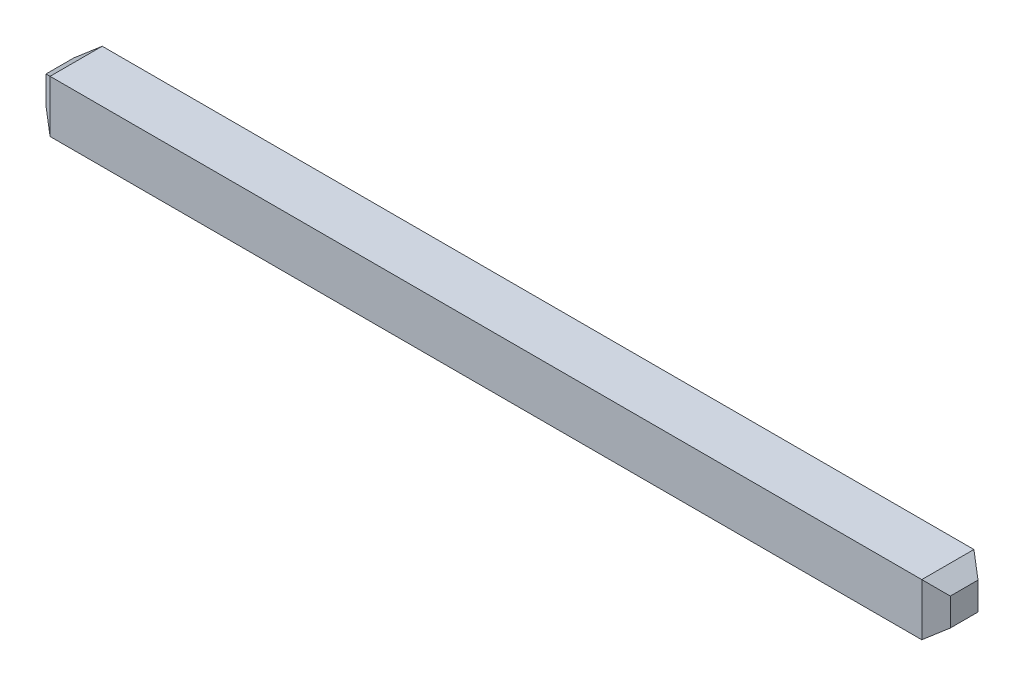
ISO-10303-21;
HEADER;
FILE_DESCRIPTION(('STEP AP214'),'2;1');
FILE_NAME('part.step','',(''),(''),'','','');
FILE_SCHEMA(('AUTOMOTIVE_DESIGN { 1 0 10303 214 1 1 1 1 }'));
ENDSEC;
DATA;
#1=APPLICATION_CONTEXT('core data for automotive mechanical design processes');
#2=APPLICATION_PROTOCOL_DEFINITION('international standard','automotive_design',2000,#1);
#3=PRODUCT_CONTEXT('',#1,'mechanical');
#4=PRODUCT('Part','Part','',(#3));
#5=PRODUCT_RELATED_PRODUCT_CATEGORY('part','',(#4));
#6=PRODUCT_DEFINITION_FORMATION('','',#4);
#7=PRODUCT_DEFINITION_CONTEXT('part definition',#1,'design');
#8=PRODUCT_DEFINITION('design','',#6,#7);
#9=PRODUCT_DEFINITION_SHAPE('','',#8);
#10=(LENGTH_UNIT() NAMED_UNIT(*) SI_UNIT(.MILLI.,.METRE.));
#11=(NAMED_UNIT(*) PLANE_ANGLE_UNIT() SI_UNIT($,.RADIAN.));
#12=(NAMED_UNIT(*) SI_UNIT($,.STERADIAN.) SOLID_ANGLE_UNIT());
#13=UNCERTAINTY_MEASURE_WITH_UNIT(LENGTH_MEASURE(1.E-05),#10,'distance_accuracy_value','');
#14=(GEOMETRIC_REPRESENTATION_CONTEXT(3) GLOBAL_UNCERTAINTY_ASSIGNED_CONTEXT((#13)) GLOBAL_UNIT_ASSIGNED_CONTEXT((#10,
#11,#12)) REPRESENTATION_CONTEXT('',''));
#15=CARTESIAN_POINT('',(0.,0.,0.));
#16=DIRECTION('',(0.,0.,1.));
#17=DIRECTION('',(1.,0.,0.));
#18=AXIS2_PLACEMENT_3D('',#15,#16,#17);
#19=CARTESIAN_POINT('',(-2.4,1.23,-37.075));
#20=DIRECTION('',(0.5999999999908,0.,0.8000000000069));
#21=DIRECTION('',(0.8000000000069,0.,-0.5999999999908));
#22=AXIS2_PLACEMENT_3D('',#19,#20,#21);
#23=PLANE('',#22);
#24=DIRECTION('',(0.,1.,0.));
#25=VECTOR('',#24,1.);
#26=CARTESIAN_POINT('',(-2.3,1.23,-37.15));
#27=LINE('',#26,#25);
#28=CARTESIAN_POINT('',(-2.29999999999957,1.55,-37.1499999999994));
#29=VERTEX_POINT('',#28);
#30=CARTESIAN_POINT('',(-2.29999999999958,0.909999999999898,-37.1499999999994));
#31=VERTEX_POINT('',#30);
#32=EDGE_CURVE('E101',#29,#31,#27,.F.);
#33=ORIENTED_EDGE('',*,*,#32,.T.);
#34=DIRECTION('',(-0.685994340569487,0.514495755428337,0.514495755427447));
#35=VECTOR('',#34,1.);
#36=CARTESIAN_POINT('',(-2.30000000000009,0.909999999999786,-37.15));
#37=LINE('',#36,#35);
#38=CARTESIAN_POINT('',(-2.50000000000021,1.06000000000001,-37.0000000000003));
#39=VERTEX_POINT('',#38);
#40=EDGE_CURVE('E85',#31,#39,#37,.T.);
#41=ORIENTED_EDGE('',*,*,#40,.T.);
#42=DIRECTION('',(0.,1.,0.));
#43=VECTOR('',#42,1.);
#44=CARTESIAN_POINT('',(-2.5,1.23,-37.));
#45=LINE('',#44,#43);
#46=CARTESIAN_POINT('',(-2.50000000000043,1.4,-37.0000000000006));
#47=VERTEX_POINT('',#46);
#48=EDGE_CURVE('E79',#39,#47,#45,.T.);
#49=ORIENTED_EDGE('',*,*,#48,.T.);
#50=DIRECTION('',(-0.68599434057003,-0.514495755427523,0.514495755427537));
#51=VECTOR('',#50,1.);
#52=CARTESIAN_POINT('',(-2.3,1.55,-37.15));
#53=LINE('',#52,#51);
#54=EDGE_CURVE('E20',#29,#47,#53,.T.);
#55=ORIENTED_EDGE('',*,*,#54,.F.);
#56=EDGE_LOOP('',(#33,#41,#49,#55));
#57=FACE_BOUND('',#56,.T.);
#58=ADVANCED_FACE('F17',(#57),#23,.F.);
#59=CARTESIAN_POINT('',(8.5,1.23,-37.075));
#60=DIRECTION('',(-0.5999999999908,0.,0.8000000000069));
#61=DIRECTION('',(0.8000000000069,0.,0.5999999999908));
#62=AXIS2_PLACEMENT_3D('',#59,#60,#61);
#63=PLANE('',#62);
#64=DIRECTION('',(0.,1.,0.));
#65=VECTOR('',#64,1.);
#66=CARTESIAN_POINT('',(8.6,1.23,-37.));
#67=LINE('',#66,#65);
#68=CARTESIAN_POINT('',(8.6000000000002,1.06000000000003,-37.0000000000003));
#69=VERTEX_POINT('',#68);
#70=CARTESIAN_POINT('',(8.60000000000043,1.4,-37.0000000000006));
#71=VERTEX_POINT('',#70);
#72=EDGE_CURVE('E113',#69,#71,#67,.T.);
#73=ORIENTED_EDGE('',*,*,#72,.F.);
#74=DIRECTION('',(-0.685994340569488,-0.514495755428337,-0.514495755427446));
#75=VECTOR('',#74,1.);
#76=CARTESIAN_POINT('',(8.59999999999996,1.06000000000005,-37.));
#77=LINE('',#76,#75);
#78=CARTESIAN_POINT('',(8.39999999999959,0.909999999999884,-37.1499999999994));
#79=VERTEX_POINT('',#78);
#80=EDGE_CURVE('E108',#69,#79,#77,.T.);
#81=ORIENTED_EDGE('',*,*,#80,.T.);
#82=DIRECTION('',(0.,1.,0.));
#83=VECTOR('',#82,1.);
#84=CARTESIAN_POINT('',(8.4,1.23,-37.15));
#85=LINE('',#84,#83);
#86=CARTESIAN_POINT('',(8.39999999999957,1.55,-37.1499999999994));
#87=VERTEX_POINT('',#86);
#88=EDGE_CURVE('E99',#79,#87,#85,.T.);
#89=ORIENTED_EDGE('',*,*,#88,.T.);
#90=DIRECTION('',(-0.685994340570029,0.514495755427522,-0.51449575542754));
#91=VECTOR('',#90,1.);
#92=CARTESIAN_POINT('',(8.6,1.4,-37.));
#93=LINE('',#92,#91);
#94=EDGE_CURVE('E116',#71,#87,#93,.T.);
#95=ORIENTED_EDGE('',*,*,#94,.F.);
#96=EDGE_LOOP('',(#73,#81,#89,#95));
#97=FACE_BOUND('',#96,.T.);
#98=ADVANCED_FACE('F214',(#97),#63,.F.);
#99=CARTESIAN_POINT('',(-2.4,1.475,-36.83));
#100=DIRECTION('',(-0.6,0.8,0.));
#101=DIRECTION('',(-0.8,-0.6,0.));
#102=AXIS2_PLACEMENT_3D('',#99,#100,#101);
#103=PLANE('',#102);
#104=DIRECTION('',(-0.685994340575993,-0.514495755427534,-0.514495755419575));
#105=VECTOR('',#104,1.);
#106=CARTESIAN_POINT('',(-2.29999999999913,1.55,-36.5100000000012));
#107=LINE('',#106,#105);
#108=CARTESIAN_POINT('',(-2.29999999999989,1.55,-36.5100000000001));
#109=VERTEX_POINT('',#108);
#110=CARTESIAN_POINT('',(-2.50000000000022,1.4,-36.6599999999997));
#111=VERTEX_POINT('',#110);
#112=EDGE_CURVE('E128',#109,#111,#107,.T.);
#113=ORIENTED_EDGE('',*,*,#112,.F.);
#114=DIRECTION('',(0.,0.,1.));
#115=VECTOR('',#114,1.);
#116=CARTESIAN_POINT('',(-2.3,1.55,-36.83));
#117=LINE('',#116,#115);
#118=EDGE_CURVE('E93',#29,#109,#117,.T.);
#119=ORIENTED_EDGE('',*,*,#118,.F.);
#120=ORIENTED_EDGE('',*,*,#54,.T.);
#121=DIRECTION('',(0.,0.,-1.));
#122=VECTOR('',#121,1.);
#123=CARTESIAN_POINT('',(-2.5,1.4,-36.83));
#124=LINE('',#123,#122);
#125=EDGE_CURVE('E87',#47,#111,#124,.F.);
#126=ORIENTED_EDGE('',*,*,#125,.T.);
#127=EDGE_LOOP('',(#113,#119,#120,#126));
#128=FACE_BOUND('',#127,.T.);
#129=ADVANCED_FACE('F90',(#128),#103,.T.);
#130=CARTESIAN_POINT('',(-2.5,1.23,-36.83));
#131=DIRECTION('',(1.,0.,0.));
#132=DIRECTION('',(0.,0.,-1.));
#133=AXIS2_PLACEMENT_3D('',#130,#131,#132);
#134=PLANE('',#133);
#135=DIRECTION('',(0.,1.,0.));
#136=VECTOR('',#135,1.);
#137=CARTESIAN_POINT('',(-2.50000000000087,1.23,-36.6599999999988));
#138=LINE('',#137,#136);
#139=CARTESIAN_POINT('',(-2.50000000000021,1.06000000000001,-36.6599999999997));
#140=VERTEX_POINT('',#139);
#141=EDGE_CURVE('E97',#111,#140,#138,.F.);
#142=ORIENTED_EDGE('',*,*,#141,.F.);
#143=ORIENTED_EDGE('',*,*,#125,.F.);
#144=ORIENTED_EDGE('',*,*,#48,.F.);
#145=DIRECTION('',(0.,0.,1.));
#146=VECTOR('',#145,1.);
#147=CARTESIAN_POINT('',(-2.49999999999996,1.06000000000005,-36.83));
#148=LINE('',#147,#146);
#149=EDGE_CURVE('E105',#39,#140,#148,.T.);
#150=ORIENTED_EDGE('',*,*,#149,.T.);
#151=EDGE_LOOP('',(#142,#143,#144,#150));
#152=FACE_BOUND('',#151,.T.);
#153=ADVANCED_FACE('F95',(#152),#134,.F.);
#154=CARTESIAN_POINT('',(3.05,1.23,-37.15));
#155=DIRECTION('',(0.,0.,1.));
#156=DIRECTION('',(1.,0.,0.));
#157=AXIS2_PLACEMENT_3D('',#154,#155,#156);
#158=PLANE('',#157);
#159=ORIENTED_EDGE('',*,*,#32,.F.);
#160=DIRECTION('',(1.,0.,0.));
#161=VECTOR('',#160,1.);
#162=CARTESIAN_POINT('',(3.05,1.55,-37.15));
#163=LINE('',#162,#161);
#164=EDGE_CURVE('E122',#87,#29,#163,.F.);
#165=ORIENTED_EDGE('',*,*,#164,.F.);
#166=ORIENTED_EDGE('',*,*,#88,.F.);
#167=DIRECTION('',(1.,0.,0.));
#168=VECTOR('',#167,1.);
#169=CARTESIAN_POINT('',(3.05,0.91,-37.15));
#170=LINE('',#169,#168);
#171=EDGE_CURVE('E136',#79,#31,#170,.F.);
#172=ORIENTED_EDGE('',*,*,#171,.T.);
#173=EDGE_LOOP('',(#159,#165,#166,#172));
#174=FACE_BOUND('',#173,.T.);
#175=ADVANCED_FACE('F182',(#174),#158,.F.);
#176=CARTESIAN_POINT('',(-2.4,0.9849999999999,-36.83));
#177=DIRECTION('',(0.600000000000912,0.799999999999316,0.));
#178=DIRECTION('',(-0.799999999999316,0.600000000000912,0.));
#179=AXIS2_PLACEMENT_3D('',#176,#177,#178);
#180=PLANE('',#179);
#181=DIRECTION('',(0.,0.,1.));
#182=VECTOR('',#181,1.);
#183=CARTESIAN_POINT('',(-2.3,0.91,-36.83));
#184=LINE('',#183,#182);
#185=CARTESIAN_POINT('',(-2.29999999999983,0.909999999999856,-36.5100000000003));
#186=VERTEX_POINT('',#185);
#187=EDGE_CURVE('E139',#31,#186,#184,.T.);
#188=ORIENTED_EDGE('',*,*,#187,.T.);
#189=DIRECTION('',(0.685994340575871,-0.514495755427787,0.514495755419485));
#190=VECTOR('',#189,1.);
#191=CARTESIAN_POINT('',(-2.50000000000087,1.06,-36.6599999999988));
#192=LINE('',#191,#190);
#193=EDGE_CURVE('E131',#140,#186,#192,.T.);
#194=ORIENTED_EDGE('',*,*,#193,.F.);
#195=ORIENTED_EDGE('',*,*,#149,.F.);
#196=ORIENTED_EDGE('',*,*,#40,.F.);
#197=EDGE_LOOP('',(#188,#194,#195,#196));
#198=FACE_BOUND('',#197,.T.);
#199=ADVANCED_FACE('F179',(#198),#180,.F.);
#200=CARTESIAN_POINT('',(8.5,0.9849999999999,-36.83));
#201=DIRECTION('',(-0.600000000000912,0.799999999999316,0.));
#202=DIRECTION('',(-0.799999999999316,-0.600000000000912,0.));
#203=AXIS2_PLACEMENT_3D('',#200,#201,#202);
#204=PLANE('',#203);
#205=DIRECTION('',(0.,0.,-1.));
#206=VECTOR('',#205,1.);
#207=CARTESIAN_POINT('',(8.6,1.06,-36.83));
#208=LINE('',#207,#206);
#209=CARTESIAN_POINT('',(8.6000000000002,1.06000000000003,-36.6599999999997));
#210=VERTEX_POINT('',#209);
#211=EDGE_CURVE('E110',#210,#69,#208,.T.);
#212=ORIENTED_EDGE('',*,*,#211,.F.);
#213=DIRECTION('',(0.685994340575871,0.514495755427787,-0.514495755419485));
#214=VECTOR('',#213,1.);
#215=CARTESIAN_POINT('',(8.39999999999913,0.9099999999999,-36.5100000000012));
#216=LINE('',#215,#214);
#217=CARTESIAN_POINT('',(8.39999999999993,0.909999999999868,-36.5100000000001));
#218=VERTEX_POINT('',#217);
#219=EDGE_CURVE('E35',#218,#210,#216,.T.);
#220=ORIENTED_EDGE('',*,*,#219,.F.);
#221=DIRECTION('',(0.,0.,1.));
#222=VECTOR('',#221,1.);
#223=CARTESIAN_POINT('',(8.4,0.91,-36.83));
#224=LINE('',#223,#222);
#225=EDGE_CURVE('E134',#218,#79,#224,.F.);
#226=ORIENTED_EDGE('',*,*,#225,.T.);
#227=ORIENTED_EDGE('',*,*,#80,.F.);
#228=EDGE_LOOP('',(#212,#220,#226,#227));
#229=FACE_BOUND('',#228,.T.);
#230=ADVANCED_FACE('F181',(#229),#204,.F.);
#231=CARTESIAN_POINT('',(8.6,1.23,-36.83));
#232=DIRECTION('',(1.,0.,0.));
#233=DIRECTION('',(0.,0.,-1.));
#234=AXIS2_PLACEMENT_3D('',#231,#232,#233);
#235=PLANE('',#234);
#236=ORIENTED_EDGE('',*,*,#72,.T.);
#237=DIRECTION('',(0.,0.,1.));
#238=VECTOR('',#237,1.);
#239=CARTESIAN_POINT('',(8.6,1.4,-36.83));
#240=LINE('',#239,#238);
#241=CARTESIAN_POINT('',(8.60000000000022,1.4,-36.6599999999997));
#242=VERTEX_POINT('',#241);
#243=EDGE_CURVE('E119',#242,#71,#240,.F.);
#244=ORIENTED_EDGE('',*,*,#243,.F.);
#245=DIRECTION('',(0.,1.,0.));
#246=VECTOR('',#245,1.);
#247=CARTESIAN_POINT('',(8.60000000000087,1.23,-36.6599999999988));
#248=LINE('',#247,#246);
#249=EDGE_CURVE('E142',#210,#242,#248,.T.);
#250=ORIENTED_EDGE('',*,*,#249,.F.);
#251=ORIENTED_EDGE('',*,*,#211,.T.);
#252=EDGE_LOOP('',(#236,#244,#250,#251));
#253=FACE_BOUND('',#252,.T.);
#254=ADVANCED_FACE('F189',(#253),#235,.T.);
#255=CARTESIAN_POINT('',(8.5,1.475,-36.83));
#256=DIRECTION('',(0.6,0.8,0.));
#257=DIRECTION('',(-0.8,0.6,0.));
#258=AXIS2_PLACEMENT_3D('',#255,#256,#257);
#259=PLANE('',#258);
#260=DIRECTION('',(-0.685994340575992,0.514495755427535,0.514495755419576));
#261=VECTOR('',#260,1.);
#262=CARTESIAN_POINT('',(8.60000000000087,1.4,-36.6599999999988));
#263=LINE('',#262,#261);
#264=CARTESIAN_POINT('',(8.39999999999989,1.55,-36.5100000000001));
#265=VERTEX_POINT('',#264);
#266=EDGE_CURVE('E145',#242,#265,#263,.T.);
#267=ORIENTED_EDGE('',*,*,#266,.F.);
#268=ORIENTED_EDGE('',*,*,#243,.T.);
#269=ORIENTED_EDGE('',*,*,#94,.T.);
#270=DIRECTION('',(0.,0.,1.));
#271=VECTOR('',#270,1.);
#272=CARTESIAN_POINT('',(8.4,1.55,-36.83));
#273=LINE('',#272,#271);
#274=EDGE_CURVE('E125',#265,#87,#273,.F.);
#275=ORIENTED_EDGE('',*,*,#274,.F.);
#276=EDGE_LOOP('',(#267,#268,#269,#275));
#277=FACE_BOUND('',#276,.T.);
#278=ADVANCED_FACE('F170',(#277),#259,.T.);
#279=CARTESIAN_POINT('',(3.05,1.55,-36.83));
#280=DIRECTION('',(0.,1.,0.));
#281=DIRECTION('',(0.,0.,1.));
#282=AXIS2_PLACEMENT_3D('',#279,#280,#281);
#283=PLANE('',#282);
#284=DIRECTION('',(1.,0.,0.));
#285=VECTOR('',#284,1.);
#286=CARTESIAN_POINT('',(3.05,1.55,-36.51));
#287=LINE('',#286,#285);
#288=EDGE_CURVE('E148',#265,#109,#287,.F.);
#289=ORIENTED_EDGE('',*,*,#288,.F.);
#290=ORIENTED_EDGE('',*,*,#274,.T.);
#291=ORIENTED_EDGE('',*,*,#164,.T.);
#292=ORIENTED_EDGE('',*,*,#118,.T.);
#293=EDGE_LOOP('',(#289,#290,#291,#292));
#294=FACE_BOUND('',#293,.T.);
#295=ADVANCED_FACE('F173',(#294),#283,.T.);
#296=CARTESIAN_POINT('',(-2.4,1.23,-36.585));
#297=DIRECTION('',(-0.599999999990736,0.,0.800000000006948));
#298=DIRECTION('',(0.800000000006948,0.,0.599999999990736));
#299=AXIS2_PLACEMENT_3D('',#296,#297,#298);
#300=PLANE('',#299);
#301=ORIENTED_EDGE('',*,*,#193,.T.);
#302=DIRECTION('',(0.,1.,0.));
#303=VECTOR('',#302,1.);
#304=CARTESIAN_POINT('',(-2.3,1.23,-36.51));
#305=LINE('',#304,#303);
#306=EDGE_CURVE('E151',#109,#186,#305,.F.);
#307=ORIENTED_EDGE('',*,*,#306,.F.);
#308=ORIENTED_EDGE('',*,*,#112,.T.);
#309=ORIENTED_EDGE('',*,*,#141,.T.);
#310=EDGE_LOOP('',(#301,#307,#308,#309));
#311=FACE_BOUND('',#310,.T.);
#312=ADVANCED_FACE('F176',(#311),#300,.T.);
#313=CARTESIAN_POINT('',(3.05,0.91,-36.83));
#314=DIRECTION('',(0.,1.,0.));
#315=DIRECTION('',(0.,0.,1.));
#316=AXIS2_PLACEMENT_3D('',#313,#314,#315);
#317=PLANE('',#316);
#318=ORIENTED_EDGE('',*,*,#187,.F.);
#319=ORIENTED_EDGE('',*,*,#171,.F.);
#320=ORIENTED_EDGE('',*,*,#225,.F.);
#321=DIRECTION('',(1.,0.,0.));
#322=VECTOR('',#321,1.);
#323=CARTESIAN_POINT('',(3.05,0.9099999999999,-36.51));
#324=LINE('',#323,#322);
#325=EDGE_CURVE('E26',#186,#218,#324,.T.);
#326=ORIENTED_EDGE('',*,*,#325,.F.);
#327=EDGE_LOOP('',(#318,#319,#320,#326));
#328=FACE_BOUND('',#327,.T.);
#329=ADVANCED_FACE('F162',(#328),#317,.F.);
#330=CARTESIAN_POINT('',(8.5,1.23,-36.585));
#331=DIRECTION('',(0.599999999990736,0.,0.800000000006948));
#332=DIRECTION('',(0.800000000006948,0.,-0.599999999990736));
#333=AXIS2_PLACEMENT_3D('',#330,#331,#332);
#334=PLANE('',#333);
#335=ORIENTED_EDGE('',*,*,#266,.T.);
#336=DIRECTION('',(0.,1.,0.));
#337=VECTOR('',#336,1.);
#338=CARTESIAN_POINT('',(8.4,1.23,-36.51));
#339=LINE('',#338,#337);
#340=EDGE_CURVE('E11',#218,#265,#339,.T.);
#341=ORIENTED_EDGE('',*,*,#340,.F.);
#342=ORIENTED_EDGE('',*,*,#219,.T.);
#343=ORIENTED_EDGE('',*,*,#249,.T.);
#344=EDGE_LOOP('',(#335,#341,#342,#343));
#345=FACE_BOUND('',#344,.T.);
#346=ADVANCED_FACE('F166',(#345),#334,.T.);
#347=CARTESIAN_POINT('',(3.05,1.23,-36.51));
#348=DIRECTION('',(0.,0.,1.));
#349=DIRECTION('',(1.,0.,0.));
#350=AXIS2_PLACEMENT_3D('',#347,#348,#349);
#351=PLANE('',#350);
#352=ORIENTED_EDGE('',*,*,#325,.T.);
#353=ORIENTED_EDGE('',*,*,#340,.T.);
#354=ORIENTED_EDGE('',*,*,#288,.T.);
#355=ORIENTED_EDGE('',*,*,#306,.T.);
#356=EDGE_LOOP('',(#352,#353,#354,#355));
#357=FACE_BOUND('',#356,.T.);
#358=ADVANCED_FACE('F157',(#357),#351,.T.);
#359=CLOSED_SHELL('',(#58,#98,#129,#153,#175,#199,#230,#254,#278,#295,#312,#329,#346,#358));
#360=MANIFOLD_SOLID_BREP('B1',#359);
#361=ADVANCED_BREP_SHAPE_REPRESENTATION('',(#18,#360),#14);
#362=SHAPE_DEFINITION_REPRESENTATION(#9,#361);
ENDSEC;
END-ISO-10303-21;
